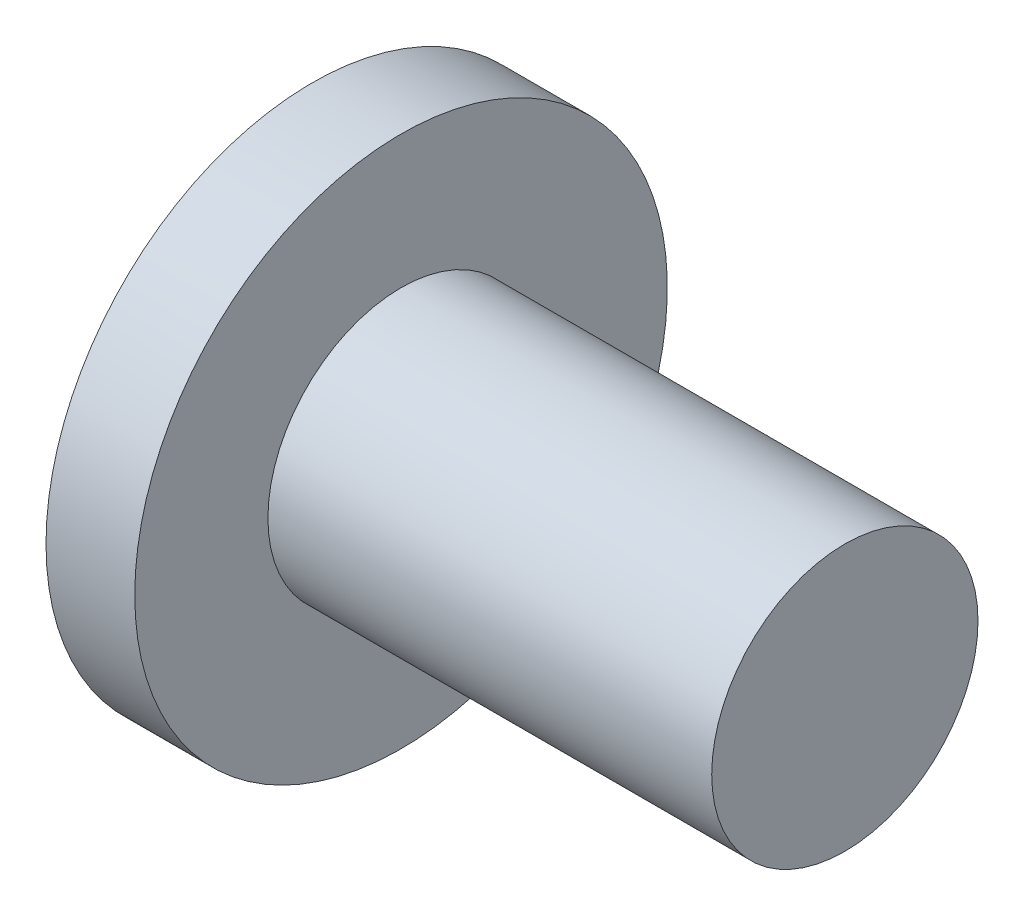
ISO-10303-21;
HEADER;
FILE_DESCRIPTION(('STEP AP214'),'2;1');
FILE_NAME('part.step','',(''),(''),'','','');
FILE_SCHEMA(('AUTOMOTIVE_DESIGN { 1 0 10303 214 1 1 1 1 }'));
ENDSEC;
DATA;
#1=APPLICATION_CONTEXT('core data for automotive mechanical design processes');
#2=APPLICATION_PROTOCOL_DEFINITION('international standard','automotive_design',2000,#1);
#3=PRODUCT_CONTEXT('',#1,'mechanical');
#4=PRODUCT('Part','Part','',(#3));
#5=PRODUCT_RELATED_PRODUCT_CATEGORY('part','',(#4));
#6=PRODUCT_DEFINITION_FORMATION('','',#4);
#7=PRODUCT_DEFINITION_CONTEXT('part definition',#1,'design');
#8=PRODUCT_DEFINITION('design','',#6,#7);
#9=PRODUCT_DEFINITION_SHAPE('','',#8);
#10=(LENGTH_UNIT() NAMED_UNIT(*) SI_UNIT(.MILLI.,.METRE.));
#11=(NAMED_UNIT(*) PLANE_ANGLE_UNIT() SI_UNIT($,.RADIAN.));
#12=(NAMED_UNIT(*) SI_UNIT($,.STERADIAN.) SOLID_ANGLE_UNIT());
#13=UNCERTAINTY_MEASURE_WITH_UNIT(LENGTH_MEASURE(1.E-05),#10,'distance_accuracy_value','');
#14=(GEOMETRIC_REPRESENTATION_CONTEXT(3) GLOBAL_UNCERTAINTY_ASSIGNED_CONTEXT((#13)) GLOBAL_UNIT_ASSIGNED_CONTEXT((#10,
#11,#12)) REPRESENTATION_CONTEXT('',''));
#15=CARTESIAN_POINT('',(0.,0.,0.));
#16=DIRECTION('',(0.,0.,1.));
#17=DIRECTION('',(1.,0.,0.));
#18=AXIS2_PLACEMENT_3D('',#15,#16,#17);
#19=CARTESIAN_POINT('',(0.,0.,0.));
#20=DIRECTION('',(1.,0.,0.));
#21=DIRECTION('',(0.,0.,-1.));
#22=AXIS2_PLACEMENT_3D('',#19,#20,#21);
#23=PLANE('',#22);
#24=CARTESIAN_POINT('',(0.,0.,0.));
#25=DIRECTION('',(-1.,0.,0.));
#26=DIRECTION('',(0.,0.,1.));
#27=AXIS2_PLACEMENT_3D('',#24,#25,#26);
#28=CIRCLE('',#27,6.);
#29=CARTESIAN_POINT('',(0.,0.,6.));
#30=VERTEX_POINT('',#29);
#31=EDGE_CURVE('E10',#30,#30,#28,.T.);
#32=ORIENTED_EDGE('',*,*,#31,.T.);
#33=EDGE_LOOP('',(#32));
#34=FACE_BOUND('',#33,.T.);
#35=ADVANCED_FACE('F41',(#34),#23,.F.);
#36=CARTESIAN_POINT('',(-21.4702702702703,0.,0.));
#37=DIRECTION('',(-1.,0.,0.));
#38=DIRECTION('',(0.,0.,1.));
#39=AXIS2_PLACEMENT_3D('',#36,#37,#38);
#40=CYLINDRICAL_SURFACE('',#39,6.);
#41=ORIENTED_EDGE('',*,*,#31,.F.);
#42=EDGE_LOOP('',(#41));
#43=FACE_BOUND('',#42,.T.);
#44=CARTESIAN_POINT('',(2.,0.,0.));
#45=DIRECTION('',(-1.,0.,0.));
#46=DIRECTION('',(0.,0.,1.));
#47=AXIS2_PLACEMENT_3D('',#44,#45,#46);
#48=CIRCLE('',#47,6.);
#49=CARTESIAN_POINT('',(2.,0.,6.));
#50=VERTEX_POINT('',#49);
#51=EDGE_CURVE('E48',#50,#50,#48,.T.);
#52=ORIENTED_EDGE('',*,*,#51,.T.);
#53=EDGE_LOOP('',(#52));
#54=FACE_BOUND('',#53,.T.);
#55=ADVANCED_FACE('F77',(#43,#54),#40,.T.);
#56=CARTESIAN_POINT('',(2.,6.,0.));
#57=DIRECTION('',(-1.,0.,0.));
#58=DIRECTION('',(0.,0.,1.));
#59=AXIS2_PLACEMENT_3D('',#56,#57,#58);
#60=PLANE('',#59);
#61=ORIENTED_EDGE('',*,*,#51,.F.);
#62=EDGE_LOOP('',(#61));
#63=FACE_BOUND('',#62,.T.);
#64=CARTESIAN_POINT('',(2.,0.,0.));
#65=DIRECTION('',(-1.,0.,0.));
#66=DIRECTION('',(0.,0.,1.));
#67=AXIS2_PLACEMENT_3D('',#64,#65,#66);
#68=CIRCLE('',#67,3.);
#69=CARTESIAN_POINT('',(2.,0.,3.));
#70=VERTEX_POINT('',#69);
#71=EDGE_CURVE('E53',#70,#70,#68,.T.);
#72=ORIENTED_EDGE('',*,*,#71,.T.);
#73=EDGE_LOOP('',(#72));
#74=FACE_BOUND('',#73,.T.);
#75=ADVANCED_FACE('F73',(#63,#74),#60,.F.);
#76=CARTESIAN_POINT('',(-21.4702702702703,0.,0.));
#77=DIRECTION('',(-1.,0.,0.));
#78=DIRECTION('',(0.,0.,1.));
#79=AXIS2_PLACEMENT_3D('',#76,#77,#78);
#80=CYLINDRICAL_SURFACE('',#79,3.);
#81=ORIENTED_EDGE('',*,*,#71,.F.);
#82=EDGE_LOOP('',(#81));
#83=FACE_BOUND('',#82,.T.);
#84=CARTESIAN_POINT('',(12.,0.,0.));
#85=DIRECTION('',(-1.,0.,0.));
#86=DIRECTION('',(0.,0.,1.));
#87=AXIS2_PLACEMENT_3D('',#84,#85,#86);
#88=CIRCLE('',#87,3.);
#89=CARTESIAN_POINT('',(12.,0.,3.));
#90=VERTEX_POINT('',#89);
#91=EDGE_CURVE('E58',#90,#90,#88,.T.);
#92=ORIENTED_EDGE('',*,*,#91,.T.);
#93=EDGE_LOOP('',(#92));
#94=FACE_BOUND('',#93,.T.);
#95=ADVANCED_FACE('F65',(#83,#94),#80,.T.);
#96=CARTESIAN_POINT('',(12.,3.,0.));
#97=DIRECTION('',(-1.,0.,0.));
#98=DIRECTION('',(0.,0.,1.));
#99=AXIS2_PLACEMENT_3D('',#96,#97,#98);
#100=PLANE('',#99);
#101=ORIENTED_EDGE('',*,*,#91,.F.);
#102=EDGE_LOOP('',(#101));
#103=FACE_BOUND('',#102,.T.);
#104=ADVANCED_FACE('F67',(#103),#100,.F.);
#105=CLOSED_SHELL('',(#35,#55,#75,#95,#104));
#106=MANIFOLD_SOLID_BREP('B2',#105);
#107=ADVANCED_BREP_SHAPE_REPRESENTATION('',(#18,#106),#14);
#108=SHAPE_DEFINITION_REPRESENTATION(#9,#107);
ENDSEC;
END-ISO-10303-21;
